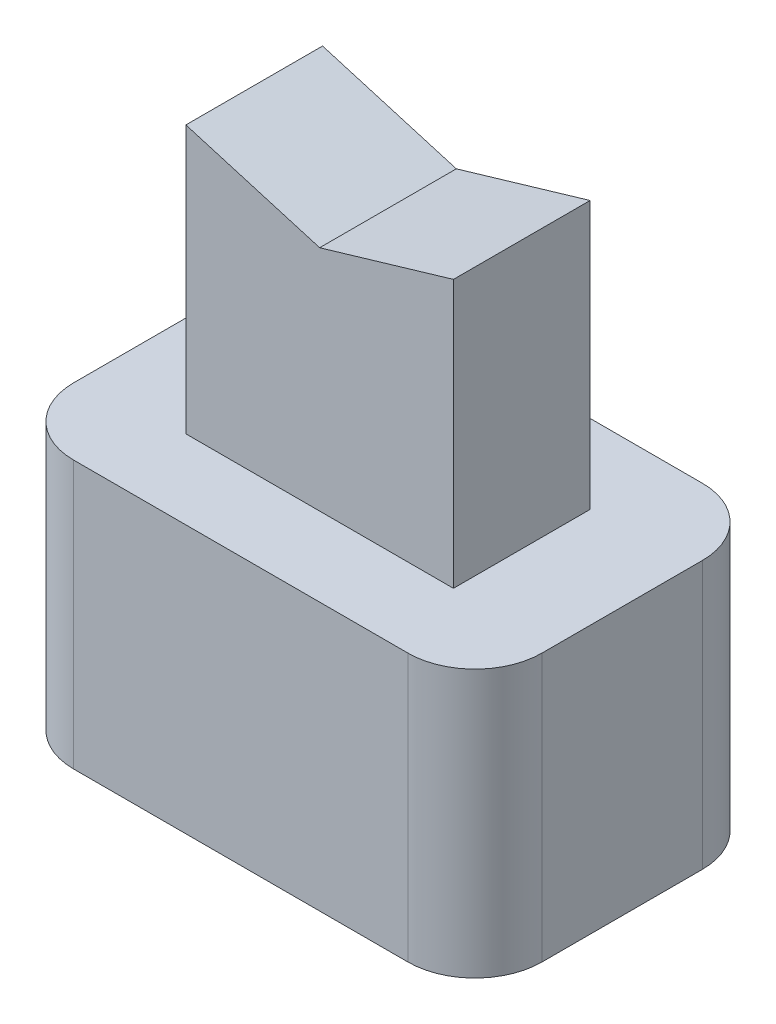
ISO-10303-21;
HEADER;
FILE_DESCRIPTION(('STEP AP214'),'2;1');
FILE_NAME('part.step','',(''),(''),'','','');
FILE_SCHEMA(('AUTOMOTIVE_DESIGN { 1 0 10303 214 1 1 1 1 }'));
ENDSEC;
DATA;
#1=APPLICATION_CONTEXT('core data for automotive mechanical design processes');
#2=APPLICATION_PROTOCOL_DEFINITION('international standard','automotive_design',2000,#1);
#3=PRODUCT_CONTEXT('',#1,'mechanical');
#4=PRODUCT('Part','Part','',(#3));
#5=PRODUCT_RELATED_PRODUCT_CATEGORY('part','',(#4));
#6=PRODUCT_DEFINITION_FORMATION('','',#4);
#7=PRODUCT_DEFINITION_CONTEXT('part definition',#1,'design');
#8=PRODUCT_DEFINITION('design','',#6,#7);
#9=PRODUCT_DEFINITION_SHAPE('','',#8);
#10=(LENGTH_UNIT() NAMED_UNIT(*) SI_UNIT(.MILLI.,.METRE.));
#11=(NAMED_UNIT(*) PLANE_ANGLE_UNIT() SI_UNIT($,.RADIAN.));
#12=(NAMED_UNIT(*) SI_UNIT($,.STERADIAN.) SOLID_ANGLE_UNIT());
#13=UNCERTAINTY_MEASURE_WITH_UNIT(LENGTH_MEASURE(1.E-05),#10,'distance_accuracy_value','');
#14=(GEOMETRIC_REPRESENTATION_CONTEXT(3) GLOBAL_UNCERTAINTY_ASSIGNED_CONTEXT((#13)) GLOBAL_UNIT_ASSIGNED_CONTEXT((#10,
#11,#12)) REPRESENTATION_CONTEXT('',''));
#15=CARTESIAN_POINT('',(0.,0.,0.));
#16=DIRECTION('',(0.,0.,1.));
#17=DIRECTION('',(1.,0.,0.));
#18=AXIS2_PLACEMENT_3D('',#15,#16,#17);
#19=CARTESIAN_POINT('',(2.,4.,-1.02154547500207));
#20=DIRECTION('',(0.,0.,-1.));
#21=DIRECTION('',(-1.,0.,0.));
#22=AXIS2_PLACEMENT_3D('',#19,#20,#21);
#23=PLANE('',#22);
#24=DIRECTION('',(0.,1.,0.));
#25=VECTOR('',#24,1.);
#26=CARTESIAN_POINT('',(-2.,4.,-1.02154547500207));
#27=LINE('',#26,#25);
#28=CARTESIAN_POINT('',(-2.,4.,-1.02154547500207));
#29=VERTEX_POINT('',#28);
#30=CARTESIAN_POINT('',(-2.,8.,-1.02154547500207));
#31=VERTEX_POINT('',#30);
#32=EDGE_CURVE('E137',#29,#31,#27,.T.);
#33=ORIENTED_EDGE('',*,*,#32,.T.);
#34=DIRECTION('',(0.959112712603681,-0.283024388563969,0.));
#35=VECTOR('',#34,1.);
#36=CARTESIAN_POINT('',(2.76539793810631,6.59377962571762,-1.02154547500207));
#37=LINE('',#36,#35);
#38=CARTESIAN_POINT('',(0.,7.40982037909674,-1.02154547500207));
#39=VERTEX_POINT('',#38);
#40=EDGE_CURVE('E49',#31,#39,#37,.T.);
#41=ORIENTED_EDGE('',*,*,#40,.T.);
#42=DIRECTION('',(0.959112712603681,0.283024388563969,0.));
#43=VECTOR('',#42,1.);
#44=CARTESIAN_POINT('',(0.914190843805652,7.67958878191197,-1.02154547500207));
#45=LINE('',#44,#43);
#46=CARTESIAN_POINT('',(2.,8.,-1.02154547500207));
#47=VERTEX_POINT('',#46);
#48=EDGE_CURVE('E140',#39,#47,#45,.T.);
#49=ORIENTED_EDGE('',*,*,#48,.T.);
#50=DIRECTION('',(0.,1.,0.));
#51=VECTOR('',#50,1.);
#52=CARTESIAN_POINT('',(2.,4.,-1.02154547500207));
#53=LINE('',#52,#51);
#54=CARTESIAN_POINT('',(2.,4.,-1.02154547500207));
#55=VERTEX_POINT('',#54);
#56=EDGE_CURVE('E129',#55,#47,#53,.T.);
#57=ORIENTED_EDGE('',*,*,#56,.F.);
#58=DIRECTION('',(-1.,0.,0.));
#59=VECTOR('',#58,1.);
#60=CARTESIAN_POINT('',(2.,4.,-1.02154547500207));
#61=LINE('',#60,#59);
#62=EDGE_CURVE('E163',#55,#29,#61,.T.);
#63=ORIENTED_EDGE('',*,*,#62,.T.);
#64=EDGE_LOOP('',(#33,#41,#49,#57,#63));
#65=FACE_BOUND('',#64,.T.);
#66=ADVANCED_FACE('F34',(#65),#23,.T.);
#67=CARTESIAN_POINT('',(2.,4.,1.02154547500207));
#68=DIRECTION('',(0.,0.,1.));
#69=DIRECTION('',(1.,0.,0.));
#70=AXIS2_PLACEMENT_3D('',#67,#68,#69);
#71=PLANE('',#70);
#72=DIRECTION('',(-0.959112712603681,-0.283024388563969,0.));
#73=VECTOR('',#72,1.);
#74=CARTESIAN_POINT('',(0.914190843805652,7.67958878191197,1.02154547500207));
#75=LINE('',#74,#73);
#76=CARTESIAN_POINT('',(2.,8.,1.02154547500207));
#77=VERTEX_POINT('',#76);
#78=CARTESIAN_POINT('',(0.,7.40982037909674,1.02154547500207));
#79=VERTEX_POINT('',#78);
#80=EDGE_CURVE('E57',#77,#79,#75,.T.);
#81=ORIENTED_EDGE('',*,*,#80,.T.);
#82=DIRECTION('',(-0.959112712603681,0.283024388563969,0.));
#83=VECTOR('',#82,1.);
#84=CARTESIAN_POINT('',(2.76539793810631,6.59377962571762,1.02154547500207));
#85=LINE('',#84,#83);
#86=CARTESIAN_POINT('',(-2.,8.,1.02154547500207));
#87=VERTEX_POINT('',#86);
#88=EDGE_CURVE('E144',#79,#87,#85,.T.);
#89=ORIENTED_EDGE('',*,*,#88,.T.);
#90=DIRECTION('',(0.,1.,0.));
#91=VECTOR('',#90,1.);
#92=CARTESIAN_POINT('',(-2.,4.,1.02154547500207));
#93=LINE('',#92,#91);
#94=CARTESIAN_POINT('',(-2.,4.,1.02154547500207));
#95=VERTEX_POINT('',#94);
#96=EDGE_CURVE('E160',#95,#87,#93,.T.);
#97=ORIENTED_EDGE('',*,*,#96,.F.);
#98=DIRECTION('',(1.,0.,0.));
#99=VECTOR('',#98,1.);
#100=CARTESIAN_POINT('',(2.,4.,1.02154547500207));
#101=LINE('',#100,#99);
#102=CARTESIAN_POINT('',(2.,4.,1.02154547500207));
#103=VERTEX_POINT('',#102);
#104=EDGE_CURVE('E151',#95,#103,#101,.T.);
#105=ORIENTED_EDGE('',*,*,#104,.T.);
#106=DIRECTION('',(0.,1.,0.));
#107=VECTOR('',#106,1.);
#108=CARTESIAN_POINT('',(2.,4.,1.02154547500207));
#109=LINE('',#108,#107);
#110=EDGE_CURVE('E138',#103,#77,#109,.T.);
#111=ORIENTED_EDGE('',*,*,#110,.T.);
#112=EDGE_LOOP('',(#81,#89,#97,#105,#111));
#113=FACE_BOUND('',#112,.T.);
#114=ADVANCED_FACE('F266',(#113),#71,.T.);
#115=CARTESIAN_POINT('',(3.5,8.,2.2));
#116=DIRECTION('',(-1.,0.,0.));
#117=DIRECTION('',(0.,0.,1.));
#118=AXIS2_PLACEMENT_3D('',#115,#116,#117);
#119=PLANE('',#118);
#120=DIRECTION('',(0.,0.,-1.));
#121=VECTOR('',#120,1.);
#122=CARTESIAN_POINT('',(3.5,0.,2.2));
#123=LINE('',#122,#121);
#124=CARTESIAN_POINT('',(3.5,0.,1.2));
#125=VERTEX_POINT('',#124);
#126=CARTESIAN_POINT('',(3.5,0.,-1.2));
#127=VERTEX_POINT('',#126);
#128=EDGE_CURVE('E172',#125,#127,#123,.T.);
#129=ORIENTED_EDGE('',*,*,#128,.T.);
#130=DIRECTION('',(0.,-1.,0.));
#131=VECTOR('',#130,1.);
#132=CARTESIAN_POINT('',(3.5,8.,-1.2));
#133=LINE('',#132,#131);
#134=CARTESIAN_POINT('',(3.5,4.,-1.2));
#135=VERTEX_POINT('',#134);
#136=EDGE_CURVE('E203',#127,#135,#133,.F.);
#137=ORIENTED_EDGE('',*,*,#136,.T.);
#138=DIRECTION('',(0.,0.,-1.));
#139=VECTOR('',#138,1.);
#140=CARTESIAN_POINT('',(3.5,4.,2.2));
#141=LINE('',#140,#139);
#142=CARTESIAN_POINT('',(3.5,4.,1.2));
#143=VERTEX_POINT('',#142);
#144=EDGE_CURVE('E169',#143,#135,#141,.T.);
#145=ORIENTED_EDGE('',*,*,#144,.F.);
#146=DIRECTION('',(0.,-1.,0.));
#147=VECTOR('',#146,1.);
#148=CARTESIAN_POINT('',(3.5,8.,1.2));
#149=LINE('',#148,#147);
#150=EDGE_CURVE('E200',#143,#125,#149,.T.);
#151=ORIENTED_EDGE('',*,*,#150,.T.);
#152=EDGE_LOOP('',(#129,#137,#145,#151));
#153=FACE_BOUND('',#152,.T.);
#154=ADVANCED_FACE('F247',(#153),#119,.F.);
#155=CARTESIAN_POINT('',(-3.5,8.,-2.2));
#156=DIRECTION('',(0.,0.,1.));
#157=DIRECTION('',(1.,0.,0.));
#158=AXIS2_PLACEMENT_3D('',#155,#156,#157);
#159=PLANE('',#158);
#160=DIRECTION('',(-1.,0.,0.));
#161=VECTOR('',#160,1.);
#162=CARTESIAN_POINT('',(-3.5,4.,-2.2));
#163=LINE('',#162,#161);
#164=CARTESIAN_POINT('',(2.5,4.,-2.2));
#165=VERTEX_POINT('',#164);
#166=CARTESIAN_POINT('',(-2.5,4.,-2.2));
#167=VERTEX_POINT('',#166);
#168=EDGE_CURVE('E166',#165,#167,#163,.T.);
#169=ORIENTED_EDGE('',*,*,#168,.F.);
#170=DIRECTION('',(0.,-1.,0.));
#171=VECTOR('',#170,1.);
#172=CARTESIAN_POINT('',(2.5,8.,-2.2));
#173=LINE('',#172,#171);
#174=CARTESIAN_POINT('',(2.5,0.,-2.2));
#175=VERTEX_POINT('',#174);
#176=EDGE_CURVE('E189',#165,#175,#173,.T.);
#177=ORIENTED_EDGE('',*,*,#176,.T.);
#178=DIRECTION('',(-1.,0.,0.));
#179=VECTOR('',#178,1.);
#180=CARTESIAN_POINT('',(-3.5,0.,-2.2));
#181=LINE('',#180,#179);
#182=CARTESIAN_POINT('',(-2.5,0.,-2.2));
#183=VERTEX_POINT('',#182);
#184=EDGE_CURVE('E175',#175,#183,#181,.T.);
#185=ORIENTED_EDGE('',*,*,#184,.T.);
#186=DIRECTION('',(0.,-1.,0.));
#187=VECTOR('',#186,1.);
#188=CARTESIAN_POINT('',(-2.5,8.,-2.2));
#189=LINE('',#188,#187);
#190=EDGE_CURVE('E187',#183,#167,#189,.F.);
#191=ORIENTED_EDGE('',*,*,#190,.T.);
#192=EDGE_LOOP('',(#169,#177,#185,#191));
#193=FACE_BOUND('',#192,.T.);
#194=ADVANCED_FACE('F255',(#193),#159,.F.);
#195=CARTESIAN_POINT('',(-3.5,8.,2.2));
#196=DIRECTION('',(1.,0.,0.));
#197=DIRECTION('',(0.,0.,-1.));
#198=AXIS2_PLACEMENT_3D('',#195,#196,#197);
#199=PLANE('',#198);
#200=DIRECTION('',(0.,0.,1.));
#201=VECTOR('',#200,1.);
#202=CARTESIAN_POINT('',(-3.5,0.,2.2));
#203=LINE('',#202,#201);
#204=CARTESIAN_POINT('',(-3.5,0.,-1.2));
#205=VERTEX_POINT('',#204);
#206=CARTESIAN_POINT('',(-3.5,0.,1.2));
#207=VERTEX_POINT('',#206);
#208=EDGE_CURVE('E178',#205,#207,#203,.T.);
#209=ORIENTED_EDGE('',*,*,#208,.T.);
#210=DIRECTION('',(0.,-1.,0.));
#211=VECTOR('',#210,1.);
#212=CARTESIAN_POINT('',(-3.5,8.,1.2));
#213=LINE('',#212,#211);
#214=CARTESIAN_POINT('',(-3.5,4.,1.2));
#215=VERTEX_POINT('',#214);
#216=EDGE_CURVE('E12',#207,#215,#213,.F.);
#217=ORIENTED_EDGE('',*,*,#216,.T.);
#218=DIRECTION('',(0.,0.,1.));
#219=VECTOR('',#218,1.);
#220=CARTESIAN_POINT('',(-3.5,4.,2.2));
#221=LINE('',#220,#219);
#222=CARTESIAN_POINT('',(-3.5,4.,-1.2));
#223=VERTEX_POINT('',#222);
#224=EDGE_CURVE('E157',#223,#215,#221,.T.);
#225=ORIENTED_EDGE('',*,*,#224,.F.);
#226=DIRECTION('',(0.,-1.,0.));
#227=VECTOR('',#226,1.);
#228=CARTESIAN_POINT('',(-3.5,8.,-1.2));
#229=LINE('',#228,#227);
#230=EDGE_CURVE('E42',#223,#205,#229,.T.);
#231=ORIENTED_EDGE('',*,*,#230,.T.);
#232=EDGE_LOOP('',(#209,#217,#225,#231));
#233=FACE_BOUND('',#232,.T.);
#234=ADVANCED_FACE('F222',(#233),#199,.F.);
#235=CARTESIAN_POINT('',(-3.5,8.,2.2));
#236=DIRECTION('',(0.,0.,-1.));
#237=DIRECTION('',(-1.,0.,0.));
#238=AXIS2_PLACEMENT_3D('',#235,#236,#237);
#239=PLANE('',#238);
#240=DIRECTION('',(1.,0.,0.));
#241=VECTOR('',#240,1.);
#242=CARTESIAN_POINT('',(-3.5,0.,2.2));
#243=LINE('',#242,#241);
#244=CARTESIAN_POINT('',(-2.5,0.,2.2));
#245=VERTEX_POINT('',#244);
#246=CARTESIAN_POINT('',(2.5,0.,2.2));
#247=VERTEX_POINT('',#246);
#248=EDGE_CURVE('E181',#245,#247,#243,.T.);
#249=ORIENTED_EDGE('',*,*,#248,.T.);
#250=DIRECTION('',(0.,-1.,0.));
#251=VECTOR('',#250,1.);
#252=CARTESIAN_POINT('',(2.5,8.,2.2));
#253=LINE('',#252,#251);
#254=CARTESIAN_POINT('',(2.5,4.,2.2));
#255=VERTEX_POINT('',#254);
#256=EDGE_CURVE('E216',#247,#255,#253,.F.);
#257=ORIENTED_EDGE('',*,*,#256,.T.);
#258=DIRECTION('',(1.,0.,0.));
#259=VECTOR('',#258,1.);
#260=CARTESIAN_POINT('',(-3.5,4.,2.2));
#261=LINE('',#260,#259);
#262=CARTESIAN_POINT('',(-2.5,4.,2.2));
#263=VERTEX_POINT('',#262);
#264=EDGE_CURVE('E184',#263,#255,#261,.T.);
#265=ORIENTED_EDGE('',*,*,#264,.F.);
#266=DIRECTION('',(0.,-1.,0.));
#267=VECTOR('',#266,1.);
#268=CARTESIAN_POINT('',(-2.5,8.,2.2));
#269=LINE('',#268,#267);
#270=EDGE_CURVE('E213',#263,#245,#269,.T.);
#271=ORIENTED_EDGE('',*,*,#270,.T.);
#272=EDGE_LOOP('',(#249,#257,#265,#271));
#273=FACE_BOUND('',#272,.T.);
#274=ADVANCED_FACE('F236',(#273),#239,.F.);
#275=CARTESIAN_POINT('',(0.,0.,0.));
#276=DIRECTION('',(0.,-1.,0.));
#277=DIRECTION('',(0.,0.,-1.));
#278=AXIS2_PLACEMENT_3D('',#275,#276,#277);
#279=PLANE('',#278);
#280=ORIENTED_EDGE('',*,*,#184,.F.);
#281=CARTESIAN_POINT('',(2.5,0.,-1.2));
#282=DIRECTION('',(0.,-1.,0.));
#283=DIRECTION('',(0.,0.,-1.));
#284=AXIS2_PLACEMENT_3D('',#281,#282,#283);
#285=CIRCLE('',#284,1.);
#286=EDGE_CURVE('E198',#175,#127,#285,.T.);
#287=ORIENTED_EDGE('',*,*,#286,.T.);
#288=ORIENTED_EDGE('',*,*,#128,.F.);
#289=CARTESIAN_POINT('',(2.5,0.,1.2));
#290=DIRECTION('',(0.,-1.,0.));
#291=DIRECTION('',(0.,0.,-1.));
#292=AXIS2_PLACEMENT_3D('',#289,#290,#291);
#293=CIRCLE('',#292,1.);
#294=EDGE_CURVE('E196',#125,#247,#293,.T.);
#295=ORIENTED_EDGE('',*,*,#294,.T.);
#296=ORIENTED_EDGE('',*,*,#248,.F.);
#297=CARTESIAN_POINT('',(-2.5,0.,1.2));
#298=DIRECTION('',(0.,-1.,0.));
#299=DIRECTION('',(0.,0.,-1.));
#300=AXIS2_PLACEMENT_3D('',#297,#298,#299);
#301=CIRCLE('',#300,1.);
#302=EDGE_CURVE('E194',#245,#207,#301,.T.);
#303=ORIENTED_EDGE('',*,*,#302,.T.);
#304=ORIENTED_EDGE('',*,*,#208,.F.);
#305=CARTESIAN_POINT('',(-2.5,0.,-1.2));
#306=DIRECTION('',(0.,-1.,0.));
#307=DIRECTION('',(0.,0.,-1.));
#308=AXIS2_PLACEMENT_3D('',#305,#306,#307);
#309=CIRCLE('',#308,1.);
#310=EDGE_CURVE('E192',#205,#183,#309,.T.);
#311=ORIENTED_EDGE('',*,*,#310,.T.);
#312=EDGE_LOOP('',(#280,#287,#288,#295,#296,#303,#304,#311));
#313=FACE_BOUND('',#312,.T.);
#314=ADVANCED_FACE('F228',(#313),#279,.T.);
#315=CARTESIAN_POINT('',(0.,4.,0.));
#316=DIRECTION('',(0.,1.,0.));
#317=DIRECTION('',(0.,0.,1.));
#318=AXIS2_PLACEMENT_3D('',#315,#316,#317);
#319=PLANE('',#318);
#320=ORIENTED_EDGE('',*,*,#62,.F.);
#321=DIRECTION('',(0.,0.,-1.));
#322=VECTOR('',#321,1.);
#323=CARTESIAN_POINT('',(2.,4.,1.02154547500207));
#324=LINE('',#323,#322);
#325=EDGE_CURVE('E134',#103,#55,#324,.T.);
#326=ORIENTED_EDGE('',*,*,#325,.F.);
#327=ORIENTED_EDGE('',*,*,#104,.F.);
#328=DIRECTION('',(0.,0.,1.));
#329=VECTOR('',#328,1.);
#330=CARTESIAN_POINT('',(-2.,4.,1.02154547500207));
#331=LINE('',#330,#329);
#332=EDGE_CURVE('E147',#29,#95,#331,.T.);
#333=ORIENTED_EDGE('',*,*,#332,.F.);
#334=EDGE_LOOP('',(#320,#326,#327,#333));
#335=FACE_BOUND('',#334,.T.);
#336=ORIENTED_EDGE('',*,*,#144,.T.);
#337=CARTESIAN_POINT('',(2.5,4.,-1.2));
#338=DIRECTION('',(0.,1.,0.));
#339=DIRECTION('',(0.,0.,1.));
#340=AXIS2_PLACEMENT_3D('',#337,#338,#339);
#341=CIRCLE('',#340,1.);
#342=EDGE_CURVE('E211',#135,#165,#341,.T.);
#343=ORIENTED_EDGE('',*,*,#342,.T.);
#344=ORIENTED_EDGE('',*,*,#168,.T.);
#345=CARTESIAN_POINT('',(-2.5,4.,-1.2));
#346=DIRECTION('',(0.,1.,0.));
#347=DIRECTION('',(0.,0.,1.));
#348=AXIS2_PLACEMENT_3D('',#345,#346,#347);
#349=CIRCLE('',#348,1.);
#350=EDGE_CURVE('E205',#167,#223,#349,.T.);
#351=ORIENTED_EDGE('',*,*,#350,.T.);
#352=ORIENTED_EDGE('',*,*,#224,.T.);
#353=CARTESIAN_POINT('',(-2.5,4.,1.2));
#354=DIRECTION('',(0.,1.,0.));
#355=DIRECTION('',(0.,0.,1.));
#356=AXIS2_PLACEMENT_3D('',#353,#354,#355);
#357=CIRCLE('',#356,1.);
#358=EDGE_CURVE('E207',#215,#263,#357,.T.);
#359=ORIENTED_EDGE('',*,*,#358,.T.);
#360=ORIENTED_EDGE('',*,*,#264,.T.);
#361=CARTESIAN_POINT('',(2.5,4.,1.2));
#362=DIRECTION('',(0.,1.,0.));
#363=DIRECTION('',(0.,0.,1.));
#364=AXIS2_PLACEMENT_3D('',#361,#362,#363);
#365=CIRCLE('',#364,1.);
#366=EDGE_CURVE('E209',#255,#143,#365,.T.);
#367=ORIENTED_EDGE('',*,*,#366,.T.);
#368=EDGE_LOOP('',(#336,#343,#344,#351,#352,#359,#360,#367));
#369=FACE_BOUND('',#368,.T.);
#370=ADVANCED_FACE('F240',(#335,#369),#319,.T.);
#371=CARTESIAN_POINT('',(-2.,4.,1.02154547500207));
#372=DIRECTION('',(-1.,0.,0.));
#373=DIRECTION('',(0.,0.,1.));
#374=AXIS2_PLACEMENT_3D('',#371,#372,#373);
#375=PLANE('',#374);
#376=DIRECTION('',(0.,0.,1.));
#377=VECTOR('',#376,1.);
#378=CARTESIAN_POINT('',(-2.,8.,1.02154547500207));
#379=LINE('',#378,#377);
#380=EDGE_CURVE('E148',#31,#87,#379,.T.);
#381=ORIENTED_EDGE('',*,*,#380,.F.);
#382=ORIENTED_EDGE('',*,*,#32,.F.);
#383=ORIENTED_EDGE('',*,*,#332,.T.);
#384=ORIENTED_EDGE('',*,*,#96,.T.);
#385=EDGE_LOOP('',(#381,#382,#383,#384));
#386=FACE_BOUND('',#385,.T.);
#387=ADVANCED_FACE('F275',(#386),#375,.T.);
#388=CARTESIAN_POINT('',(2.,4.,1.02154547500207));
#389=DIRECTION('',(1.,0.,0.));
#390=DIRECTION('',(0.,0.,-1.));
#391=AXIS2_PLACEMENT_3D('',#388,#389,#390);
#392=PLANE('',#391);
#393=DIRECTION('',(0.,0.,-1.));
#394=VECTOR('',#393,1.);
#395=CARTESIAN_POINT('',(2.,8.,1.02154547500207));
#396=LINE('',#395,#394);
#397=EDGE_CURVE('E133',#77,#47,#396,.T.);
#398=ORIENTED_EDGE('',*,*,#397,.F.);
#399=ORIENTED_EDGE('',*,*,#110,.F.);
#400=ORIENTED_EDGE('',*,*,#325,.T.);
#401=ORIENTED_EDGE('',*,*,#56,.T.);
#402=EDGE_LOOP('',(#398,#399,#400,#401));
#403=FACE_BOUND('',#402,.T.);
#404=ADVANCED_FACE('F130',(#403),#392,.T.);
#405=CARTESIAN_POINT('',(2.5,8.,-1.2));
#406=DIRECTION('',(0.,-1.,0.));
#407=DIRECTION('',(0.,0.,-1.));
#408=AXIS2_PLACEMENT_3D('',#405,#406,#407);
#409=CYLINDRICAL_SURFACE('',#408,1.);
#410=ORIENTED_EDGE('',*,*,#342,.F.);
#411=ORIENTED_EDGE('',*,*,#136,.F.);
#412=ORIENTED_EDGE('',*,*,#286,.F.);
#413=ORIENTED_EDGE('',*,*,#176,.F.);
#414=EDGE_LOOP('',(#410,#411,#412,#413));
#415=FACE_BOUND('',#414,.T.);
#416=ADVANCED_FACE('F252',(#415),#409,.T.);
#417=CARTESIAN_POINT('',(2.5,8.,1.2));
#418=DIRECTION('',(0.,-1.,0.));
#419=DIRECTION('',(0.,0.,-1.));
#420=AXIS2_PLACEMENT_3D('',#417,#418,#419);
#421=CYLINDRICAL_SURFACE('',#420,1.);
#422=ORIENTED_EDGE('',*,*,#366,.F.);
#423=ORIENTED_EDGE('',*,*,#256,.F.);
#424=ORIENTED_EDGE('',*,*,#294,.F.);
#425=ORIENTED_EDGE('',*,*,#150,.F.);
#426=EDGE_LOOP('',(#422,#423,#424,#425));
#427=FACE_BOUND('',#426,.T.);
#428=ADVANCED_FACE('F244',(#427),#421,.T.);
#429=CARTESIAN_POINT('',(-2.5,8.,1.2));
#430=DIRECTION('',(0.,-1.,0.));
#431=DIRECTION('',(0.,0.,-1.));
#432=AXIS2_PLACEMENT_3D('',#429,#430,#431);
#433=CYLINDRICAL_SURFACE('',#432,1.);
#434=ORIENTED_EDGE('',*,*,#358,.F.);
#435=ORIENTED_EDGE('',*,*,#216,.F.);
#436=ORIENTED_EDGE('',*,*,#302,.F.);
#437=ORIENTED_EDGE('',*,*,#270,.F.);
#438=EDGE_LOOP('',(#434,#435,#436,#437));
#439=FACE_BOUND('',#438,.T.);
#440=ADVANCED_FACE('F233',(#439),#433,.T.);
#441=CARTESIAN_POINT('',(-2.5,8.,-1.2));
#442=DIRECTION('',(0.,-1.,0.));
#443=DIRECTION('',(0.,0.,-1.));
#444=AXIS2_PLACEMENT_3D('',#441,#442,#443);
#445=CYLINDRICAL_SURFACE('',#444,1.);
#446=ORIENTED_EDGE('',*,*,#350,.F.);
#447=ORIENTED_EDGE('',*,*,#190,.F.);
#448=ORIENTED_EDGE('',*,*,#310,.F.);
#449=ORIENTED_EDGE('',*,*,#230,.F.);
#450=EDGE_LOOP('',(#446,#447,#448,#449));
#451=FACE_BOUND('',#450,.T.);
#452=ADVANCED_FACE('F36',(#451),#445,.T.);
#453=CARTESIAN_POINT('',(-2.,8.,18.1794543370243));
#454=DIRECTION('',(0.283024388563969,0.959112712603681,0.));
#455=DIRECTION('',(-0.959112712603681,0.283024388563969,0.));
#456=AXIS2_PLACEMENT_3D('',#453,#454,#455);
#457=PLANE('',#456);
#458=ORIENTED_EDGE('',*,*,#40,.F.);
#459=ORIENTED_EDGE('',*,*,#380,.T.);
#460=ORIENTED_EDGE('',*,*,#88,.F.);
#461=DIRECTION('',(0.,0.,-1.));
#462=VECTOR('',#461,1.);
#463=CARTESIAN_POINT('',(0.,7.40982037909674,18.1794543370243));
#464=LINE('',#463,#462);
#465=EDGE_CURVE('E398',#79,#39,#464,.T.);
#466=ORIENTED_EDGE('',*,*,#465,.T.);
#467=EDGE_LOOP('',(#458,#459,#460,#466));
#468=FACE_BOUND('',#467,.T.);
#469=ADVANCED_FACE('F258',(#468),#457,.T.);
#470=CARTESIAN_POINT('',(0.,7.40982037909674,18.1794543370243));
#471=DIRECTION('',(-0.283024388563969,0.959112712603681,0.));
#472=DIRECTION('',(-0.959112712603681,-0.283024388563969,0.));
#473=AXIS2_PLACEMENT_3D('',#470,#471,#472);
#474=PLANE('',#473);
#475=ORIENTED_EDGE('',*,*,#48,.F.);
#476=ORIENTED_EDGE('',*,*,#465,.F.);
#477=ORIENTED_EDGE('',*,*,#80,.F.);
#478=ORIENTED_EDGE('',*,*,#397,.T.);
#479=EDGE_LOOP('',(#475,#476,#477,#478));
#480=FACE_BOUND('',#479,.T.);
#481=ADVANCED_FACE('F146',(#480),#474,.T.);
#482=CLOSED_SHELL('',(#66,#114,#154,#194,#234,#274,#314,#370,#387,#404,#416,#428,#440,#452,#469,#481));
#483=MANIFOLD_SOLID_BREP('B2',#482);
#484=ADVANCED_BREP_SHAPE_REPRESENTATION('',(#18,#483),#14);
#485=SHAPE_DEFINITION_REPRESENTATION(#9,#484);
ENDSEC;
END-ISO-10303-21;
